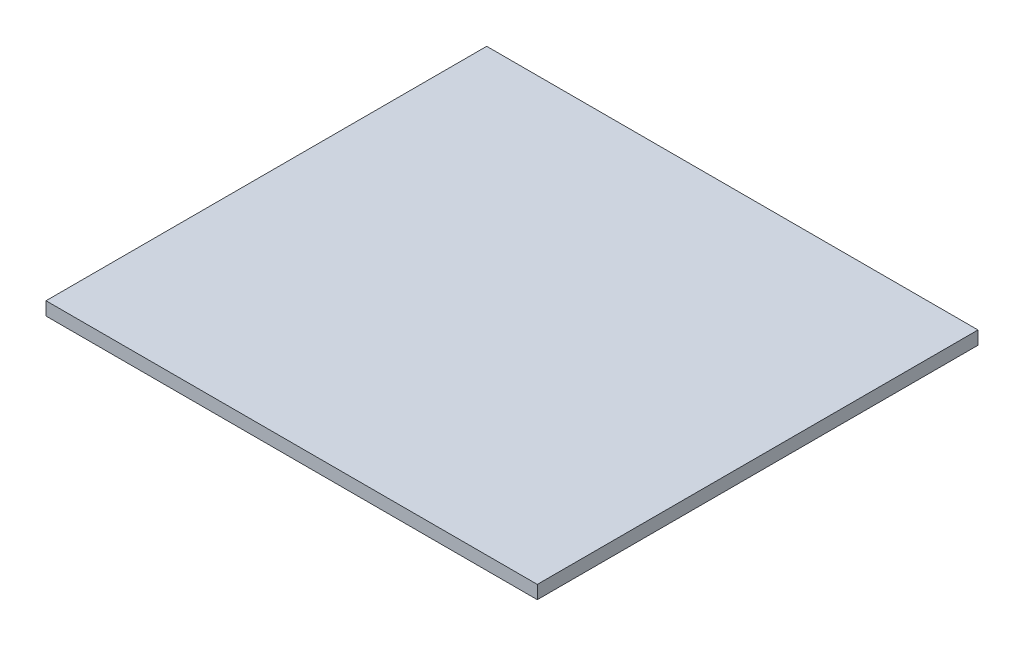
ISO-10303-21;
HEADER;
FILE_DESCRIPTION(('STEP AP214'),'2;1');
FILE_NAME('part.step','',(''),(''),'','','');
FILE_SCHEMA(('AUTOMOTIVE_DESIGN { 1 0 10303 214 1 1 1 1 }'));
ENDSEC;
DATA;
#1=APPLICATION_CONTEXT('core data for automotive mechanical design processes');
#2=APPLICATION_PROTOCOL_DEFINITION('international standard','automotive_design',2000,#1);
#3=PRODUCT_CONTEXT('',#1,'mechanical');
#4=PRODUCT('Part','Part','',(#3));
#5=PRODUCT_RELATED_PRODUCT_CATEGORY('part','',(#4));
#6=PRODUCT_DEFINITION_FORMATION('','',#4);
#7=PRODUCT_DEFINITION_CONTEXT('part definition',#1,'design');
#8=PRODUCT_DEFINITION('design','',#6,#7);
#9=PRODUCT_DEFINITION_SHAPE('','',#8);
#10=(LENGTH_UNIT() NAMED_UNIT(*) SI_UNIT(.MILLI.,.METRE.));
#11=(NAMED_UNIT(*) PLANE_ANGLE_UNIT() SI_UNIT($,.RADIAN.));
#12=(NAMED_UNIT(*) SI_UNIT($,.STERADIAN.) SOLID_ANGLE_UNIT());
#13=UNCERTAINTY_MEASURE_WITH_UNIT(LENGTH_MEASURE(1.E-05),#10,'distance_accuracy_value','');
#14=(GEOMETRIC_REPRESENTATION_CONTEXT(3) GLOBAL_UNCERTAINTY_ASSIGNED_CONTEXT((#13)) GLOBAL_UNIT_ASSIGNED_CONTEXT((#10,
#11,#12)) REPRESENTATION_CONTEXT('',''));
#15=CARTESIAN_POINT('',(0.,0.,0.));
#16=DIRECTION('',(0.,0.,1.));
#17=DIRECTION('',(1.,0.,0.));
#18=AXIS2_PLACEMENT_3D('',#15,#16,#17);
#19=CARTESIAN_POINT('',(-235.,12.7,210.8));
#20=DIRECTION('',(1.,0.,0.));
#21=DIRECTION('',(0.,0.,-1.));
#22=AXIS2_PLACEMENT_3D('',#19,#20,#21);
#23=PLANE('',#22);
#24=DIRECTION('',(0.,0.,1.));
#25=VECTOR('',#24,1.);
#26=CARTESIAN_POINT('',(-235.,0.,210.8));
#27=LINE('',#26,#25);
#28=CARTESIAN_POINT('',(-235.,0.,-210.8));
#29=VERTEX_POINT('',#28);
#30=CARTESIAN_POINT('',(-235.,0.,210.8));
#31=VERTEX_POINT('',#30);
#32=EDGE_CURVE('E98',#29,#31,#27,.T.);
#33=ORIENTED_EDGE('',*,*,#32,.T.);
#34=DIRECTION('',(0.,-1.,0.));
#35=VECTOR('',#34,1.);
#36=CARTESIAN_POINT('',(-235.,12.7,210.8));
#37=LINE('',#36,#35);
#38=CARTESIAN_POINT('',(-235.,12.7,210.8));
#39=VERTEX_POINT('',#38);
#40=EDGE_CURVE('E11',#39,#31,#37,.T.);
#41=ORIENTED_EDGE('',*,*,#40,.F.);
#42=DIRECTION('',(0.,0.,1.));
#43=VECTOR('',#42,1.);
#44=CARTESIAN_POINT('',(-235.,12.7,210.8));
#45=LINE('',#44,#43);
#46=CARTESIAN_POINT('',(-235.,12.7,-210.8));
#47=VERTEX_POINT('',#46);
#48=EDGE_CURVE('E86',#47,#39,#45,.T.);
#49=ORIENTED_EDGE('',*,*,#48,.F.);
#50=DIRECTION('',(0.,-1.,0.));
#51=VECTOR('',#50,1.);
#52=CARTESIAN_POINT('',(-235.,12.7,-210.8));
#53=LINE('',#52,#51);
#54=EDGE_CURVE('E94',#47,#29,#53,.T.);
#55=ORIENTED_EDGE('',*,*,#54,.T.);
#56=EDGE_LOOP('',(#33,#41,#49,#55));
#57=FACE_BOUND('',#56,.T.);
#58=ADVANCED_FACE('F35',(#57),#23,.F.);
#59=CARTESIAN_POINT('',(235.,12.7,210.8));
#60=DIRECTION('',(0.,0.,-1.));
#61=DIRECTION('',(-1.,0.,0.));
#62=AXIS2_PLACEMENT_3D('',#59,#60,#61);
#63=PLANE('',#62);
#64=DIRECTION('',(1.,0.,0.));
#65=VECTOR('',#64,1.);
#66=CARTESIAN_POINT('',(235.,0.,210.8));
#67=LINE('',#66,#65);
#68=CARTESIAN_POINT('',(235.,0.,210.8));
#69=VERTEX_POINT('',#68);
#70=EDGE_CURVE('E90',#31,#69,#67,.T.);
#71=ORIENTED_EDGE('',*,*,#70,.T.);
#72=DIRECTION('',(0.,-1.,0.));
#73=VECTOR('',#72,1.);
#74=CARTESIAN_POINT('',(235.,12.7,210.8));
#75=LINE('',#74,#73);
#76=CARTESIAN_POINT('',(235.,12.7,210.8));
#77=VERTEX_POINT('',#76);
#78=EDGE_CURVE('E43',#77,#69,#75,.T.);
#79=ORIENTED_EDGE('',*,*,#78,.F.);
#80=DIRECTION('',(1.,0.,0.));
#81=VECTOR('',#80,1.);
#82=CARTESIAN_POINT('',(235.,12.7,210.8));
#83=LINE('',#82,#81);
#84=EDGE_CURVE('E81',#39,#77,#83,.T.);
#85=ORIENTED_EDGE('',*,*,#84,.F.);
#86=ORIENTED_EDGE('',*,*,#40,.T.);
#87=EDGE_LOOP('',(#71,#79,#85,#86));
#88=FACE_BOUND('',#87,.T.);
#89=ADVANCED_FACE('F89',(#88),#63,.F.);
#90=CARTESIAN_POINT('',(235.,12.7,210.8));
#91=DIRECTION('',(-1.,0.,0.));
#92=DIRECTION('',(0.,0.,1.));
#93=AXIS2_PLACEMENT_3D('',#90,#91,#92);
#94=PLANE('',#93);
#95=DIRECTION('',(0.,0.,-1.));
#96=VECTOR('',#95,1.);
#97=CARTESIAN_POINT('',(235.,0.,210.8));
#98=LINE('',#97,#96);
#99=CARTESIAN_POINT('',(235.,0.,-210.8));
#100=VERTEX_POINT('',#99);
#101=EDGE_CURVE('E68',#69,#100,#98,.T.);
#102=ORIENTED_EDGE('',*,*,#101,.T.);
#103=DIRECTION('',(0.,-1.,0.));
#104=VECTOR('',#103,1.);
#105=CARTESIAN_POINT('',(235.,12.7,-210.8));
#106=LINE('',#105,#104);
#107=CARTESIAN_POINT('',(235.,12.7,-210.8));
#108=VERTEX_POINT('',#107);
#109=EDGE_CURVE('E91',#108,#100,#106,.T.);
#110=ORIENTED_EDGE('',*,*,#109,.F.);
#111=DIRECTION('',(0.,0.,-1.));
#112=VECTOR('',#111,1.);
#113=CARTESIAN_POINT('',(235.,12.7,210.8));
#114=LINE('',#113,#112);
#115=EDGE_CURVE('E84',#77,#108,#114,.T.);
#116=ORIENTED_EDGE('',*,*,#115,.F.);
#117=ORIENTED_EDGE('',*,*,#78,.T.);
#118=EDGE_LOOP('',(#102,#110,#116,#117));
#119=FACE_BOUND('',#118,.T.);
#120=ADVANCED_FACE('F92',(#119),#94,.F.);
#121=CARTESIAN_POINT('',(235.,12.7,-210.8));
#122=DIRECTION('',(0.,0.,1.));
#123=DIRECTION('',(1.,0.,0.));
#124=AXIS2_PLACEMENT_3D('',#121,#122,#123);
#125=PLANE('',#124);
#126=DIRECTION('',(-1.,0.,0.));
#127=VECTOR('',#126,1.);
#128=CARTESIAN_POINT('',(235.,0.,-210.8));
#129=LINE('',#128,#127);
#130=EDGE_CURVE('E74',#100,#29,#129,.T.);
#131=ORIENTED_EDGE('',*,*,#130,.T.);
#132=ORIENTED_EDGE('',*,*,#54,.F.);
#133=DIRECTION('',(-1.,0.,0.));
#134=VECTOR('',#133,1.);
#135=CARTESIAN_POINT('',(235.,12.7,-210.8));
#136=LINE('',#135,#134);
#137=EDGE_CURVE('E51',#108,#47,#136,.T.);
#138=ORIENTED_EDGE('',*,*,#137,.F.);
#139=ORIENTED_EDGE('',*,*,#109,.T.);
#140=EDGE_LOOP('',(#131,#132,#138,#139));
#141=FACE_BOUND('',#140,.T.);
#142=ADVANCED_FACE('F105',(#141),#125,.F.);
#143=CARTESIAN_POINT('',(0.,12.7,0.));
#144=DIRECTION('',(0.,1.,0.));
#145=DIRECTION('',(0.,0.,1.));
#146=AXIS2_PLACEMENT_3D('',#143,#144,#145);
#147=PLANE('',#146);
#148=ORIENTED_EDGE('',*,*,#48,.T.);
#149=ORIENTED_EDGE('',*,*,#84,.T.);
#150=ORIENTED_EDGE('',*,*,#115,.T.);
#151=ORIENTED_EDGE('',*,*,#137,.T.);
#152=EDGE_LOOP('',(#148,#149,#150,#151));
#153=FACE_BOUND('',#152,.T.);
#154=ADVANCED_FACE('F82',(#153),#147,.T.);
#155=CARTESIAN_POINT('',(0.,0.,0.));
#156=DIRECTION('',(0.,1.,0.));
#157=DIRECTION('',(0.,0.,1.));
#158=AXIS2_PLACEMENT_3D('',#155,#156,#157);
#159=PLANE('',#158);
#160=ORIENTED_EDGE('',*,*,#32,.F.);
#161=ORIENTED_EDGE('',*,*,#130,.F.);
#162=ORIENTED_EDGE('',*,*,#101,.F.);
#163=ORIENTED_EDGE('',*,*,#70,.F.);
#164=EDGE_LOOP('',(#160,#161,#162,#163));
#165=FACE_BOUND('',#164,.T.);
#166=ADVANCED_FACE('F108',(#165),#159,.F.);
#167=CLOSED_SHELL('',(#58,#89,#120,#142,#154,#166));
#168=MANIFOLD_SOLID_BREP('B2',#167);
#169=ADVANCED_BREP_SHAPE_REPRESENTATION('',(#18,#168),#14);
#170=SHAPE_DEFINITION_REPRESENTATION(#9,#169);
ENDSEC;
END-ISO-10303-21;
